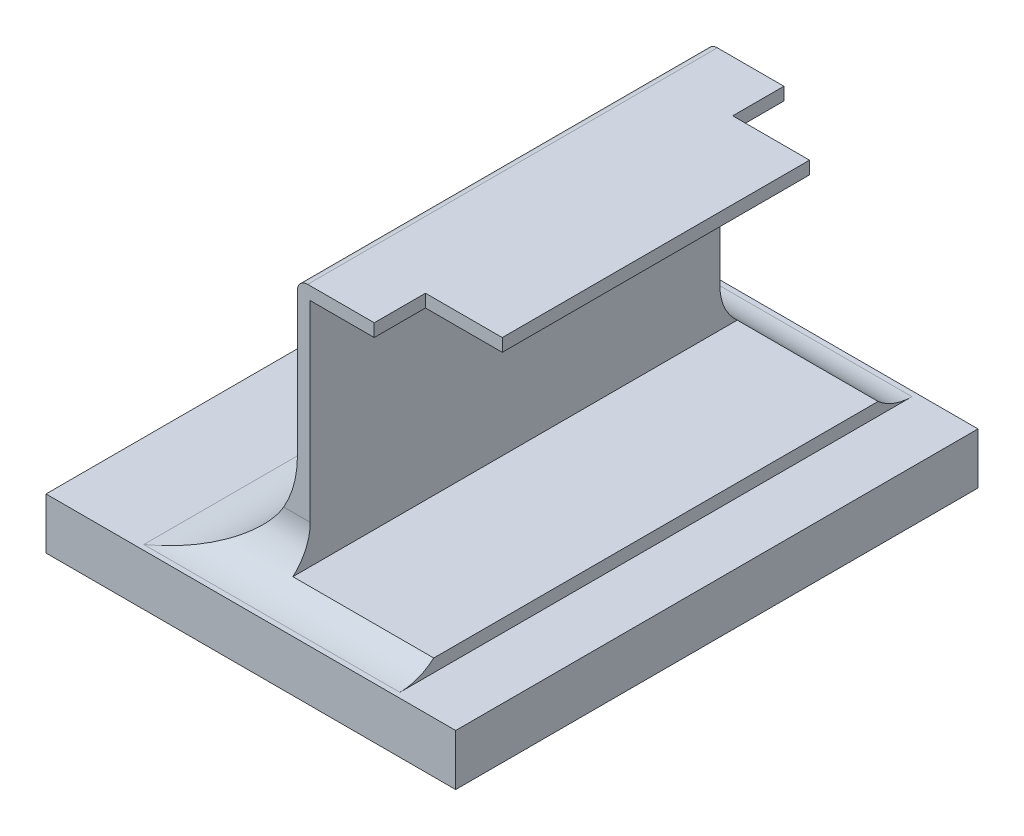
ISO-10303-21;
HEADER;
FILE_DESCRIPTION(('STEP AP214'),'2;1');
FILE_NAME('part.step','',(''),(''),'','','');
FILE_SCHEMA(('AUTOMOTIVE_DESIGN { 1 0 10303 214 1 1 1 1 }'));
ENDSEC;
DATA;
#1=APPLICATION_CONTEXT('core data for automotive mechanical design processes');
#2=APPLICATION_PROTOCOL_DEFINITION('international standard','automotive_design',2000,#1);
#3=PRODUCT_CONTEXT('',#1,'mechanical');
#4=PRODUCT('Part','Part','',(#3));
#5=PRODUCT_RELATED_PRODUCT_CATEGORY('part','',(#4));
#6=PRODUCT_DEFINITION_FORMATION('','',#4);
#7=PRODUCT_DEFINITION_CONTEXT('part definition',#1,'design');
#8=PRODUCT_DEFINITION('design','',#6,#7);
#9=PRODUCT_DEFINITION_SHAPE('','',#8);
#10=(LENGTH_UNIT() NAMED_UNIT(*) SI_UNIT(.MILLI.,.METRE.));
#11=(NAMED_UNIT(*) PLANE_ANGLE_UNIT() SI_UNIT($,.RADIAN.));
#12=(NAMED_UNIT(*) SI_UNIT($,.STERADIAN.) SOLID_ANGLE_UNIT());
#13=UNCERTAINTY_MEASURE_WITH_UNIT(LENGTH_MEASURE(1.E-05),#10,'distance_accuracy_value','');
#14=(GEOMETRIC_REPRESENTATION_CONTEXT(3) GLOBAL_UNCERTAINTY_ASSIGNED_CONTEXT((#13)) GLOBAL_UNIT_ASSIGNED_CONTEXT((#10,
#11,#12)) REPRESENTATION_CONTEXT('',''));
#15=CARTESIAN_POINT('',(0.,0.,0.));
#16=DIRECTION('',(0.,0.,1.));
#17=DIRECTION('',(1.,0.,0.));
#18=AXIS2_PLACEMENT_3D('',#15,#16,#17);
#19=CARTESIAN_POINT('',(-0.65,0.575,-0.3));
#20=DIRECTION('',(0.,0.,1.));
#21=DIRECTION('',(1.,0.,0.));
#22=AXIS2_PLACEMENT_3D('',#19,#20,#21);
#23=PLANE('',#22);
#24=DIRECTION('',(0.,1.,0.));
#25=VECTOR('',#24,1.);
#26=CARTESIAN_POINT('',(-0.65,0.575,-0.3));
#27=LINE('',#26,#25);
#28=CARTESIAN_POINT('',(-0.65,0.575,-0.3));
#29=VERTEX_POINT('',#28);
#30=CARTESIAN_POINT('',(-0.650000000008889,0.6,-0.3));
#31=VERTEX_POINT('',#30);
#32=EDGE_CURVE('E214',#29,#31,#27,.T.);
#33=ORIENTED_EDGE('',*,*,#32,.T.);
#34=DIRECTION('',(1.,0.,0.));
#35=VECTOR('',#34,1.);
#36=CARTESIAN_POINT('',(-0.78,0.6,-0.3));
#37=LINE('',#36,#35);
#38=CARTESIAN_POINT('',(-0.5,0.6,-0.3));
#39=VERTEX_POINT('',#38);
#40=EDGE_CURVE('E213',#31,#39,#37,.T.);
#41=ORIENTED_EDGE('',*,*,#40,.T.);
#42=DIRECTION('',(0.,1.,0.));
#43=VECTOR('',#42,1.);
#44=CARTESIAN_POINT('',(-0.5,0.575,-0.3));
#45=LINE('',#44,#43);
#46=CARTESIAN_POINT('',(-0.5,0.575,-0.3));
#47=VERTEX_POINT('',#46);
#48=EDGE_CURVE('E264',#39,#47,#45,.F.);
#49=ORIENTED_EDGE('',*,*,#48,.T.);
#50=DIRECTION('',(1.,0.,0.));
#51=VECTOR('',#50,1.);
#52=CARTESIAN_POINT('',(-0.775,0.575,-0.3));
#53=LINE('',#52,#51);
#54=EDGE_CURVE('E233',#47,#29,#53,.F.);
#55=ORIENTED_EDGE('',*,*,#54,.T.);
#56=EDGE_LOOP('',(#33,#41,#49,#55));
#57=FACE_BOUND('',#56,.T.);
#58=ADVANCED_FACE('F17',(#57),#23,.F.);
#59=CARTESIAN_POINT('',(-0.5,0.575,-0.3));
#60=DIRECTION('',(-1.,0.,0.));
#61=DIRECTION('',(0.,0.,1.));
#62=AXIS2_PLACEMENT_3D('',#59,#60,#61);
#63=PLANE('',#62);
#64=DIRECTION('',(0.,1.,0.));
#65=VECTOR('',#64,1.);
#66=CARTESIAN_POINT('',(-0.5,0.575,0.3));
#67=LINE('',#66,#65);
#68=CARTESIAN_POINT('',(-0.5,0.6,0.3));
#69=VERTEX_POINT('',#68);
#70=CARTESIAN_POINT('',(-0.5,0.575,0.3));
#71=VERTEX_POINT('',#70);
#72=EDGE_CURVE('E256',#69,#71,#67,.F.);
#73=ORIENTED_EDGE('',*,*,#72,.T.);
#74=DIRECTION('',(0.,0.,1.));
#75=VECTOR('',#74,1.);
#76=CARTESIAN_POINT('',(-0.5,0.575,-0.4));
#77=LINE('',#76,#75);
#78=EDGE_CURVE('E246',#71,#47,#77,.F.);
#79=ORIENTED_EDGE('',*,*,#78,.T.);
#80=ORIENTED_EDGE('',*,*,#48,.F.);
#81=DIRECTION('',(0.,0.,-1.));
#82=VECTOR('',#81,1.);
#83=CARTESIAN_POINT('',(-0.5,0.6,0.4));
#84=LINE('',#83,#82);
#85=EDGE_CURVE('E251',#39,#69,#84,.F.);
#86=ORIENTED_EDGE('',*,*,#85,.T.);
#87=EDGE_LOOP('',(#73,#79,#80,#86));
#88=FACE_BOUND('',#87,.T.);
#89=ADVANCED_FACE('F458',(#88),#63,.F.);
#90=CARTESIAN_POINT('',(-0.5,0.575,0.3));
#91=DIRECTION('',(0.,0.,-1.));
#92=DIRECTION('',(-1.,0.,0.));
#93=AXIS2_PLACEMENT_3D('',#90,#91,#92);
#94=PLANE('',#93);
#95=ORIENTED_EDGE('',*,*,#72,.F.);
#96=DIRECTION('',(1.,0.,0.));
#97=VECTOR('',#96,1.);
#98=CARTESIAN_POINT('',(-0.78,0.6,0.3));
#99=LINE('',#98,#97);
#100=CARTESIAN_POINT('',(-0.650000000017778,0.6,0.3));
#101=VERTEX_POINT('',#100);
#102=EDGE_CURVE('E241',#69,#101,#99,.F.);
#103=ORIENTED_EDGE('',*,*,#102,.T.);
#104=DIRECTION('',(0.,1.,0.));
#105=VECTOR('',#104,1.);
#106=CARTESIAN_POINT('',(-0.65,0.575,0.3));
#107=LINE('',#106,#105);
#108=CARTESIAN_POINT('',(-0.649999999967593,0.575,0.3));
#109=VERTEX_POINT('',#108);
#110=EDGE_CURVE('E254',#101,#109,#107,.F.);
#111=ORIENTED_EDGE('',*,*,#110,.T.);
#112=DIRECTION('',(1.,0.,0.));
#113=VECTOR('',#112,1.);
#114=CARTESIAN_POINT('',(-0.775,0.575,0.3));
#115=LINE('',#114,#113);
#116=EDGE_CURVE('E232',#109,#71,#115,.T.);
#117=ORIENTED_EDGE('',*,*,#116,.T.);
#118=EDGE_LOOP('',(#95,#103,#111,#117));
#119=FACE_BOUND('',#118,.T.);
#120=ADVANCED_FACE('F455',(#119),#94,.F.);
#121=CARTESIAN_POINT('',(-0.65,0.575,0.3));
#122=DIRECTION('',(-1.,0.,0.));
#123=DIRECTION('',(0.,0.,1.));
#124=AXIS2_PLACEMENT_3D('',#121,#122,#123);
#125=PLANE('',#124);
#126=ORIENTED_EDGE('',*,*,#110,.F.);
#127=DIRECTION('',(0.,0.,-1.));
#128=VECTOR('',#127,1.);
#129=CARTESIAN_POINT('',(-0.650000000026667,0.6,0.4));
#130=LINE('',#129,#128);
#131=CARTESIAN_POINT('',(-0.649999999967222,0.6,0.4));
#132=VERTEX_POINT('',#131);
#133=EDGE_CURVE('E200',#101,#132,#130,.F.);
#134=ORIENTED_EDGE('',*,*,#133,.T.);
#135=DIRECTION('',(0.,1.,0.));
#136=VECTOR('',#135,1.);
#137=CARTESIAN_POINT('',(-0.6499999999375,0.2,0.4));
#138=LINE('',#137,#136);
#139=CARTESIAN_POINT('',(-0.6499999999375,0.575,0.4));
#140=VERTEX_POINT('',#139);
#141=EDGE_CURVE('E169',#140,#132,#138,.T.);
#142=ORIENTED_EDGE('',*,*,#141,.F.);
#143=DIRECTION('',(0.,0.,1.));
#144=VECTOR('',#143,1.);
#145=CARTESIAN_POINT('',(-0.6499999999375,0.575,-0.4));
#146=LINE('',#145,#144);
#147=EDGE_CURVE('E229',#140,#109,#146,.F.);
#148=ORIENTED_EDGE('',*,*,#147,.T.);
#149=EDGE_LOOP('',(#126,#134,#142,#148));
#150=FACE_BOUND('',#149,.T.);
#151=ADVANCED_FACE('F451',(#150),#125,.F.);
#152=CARTESIAN_POINT('',(-0.775,0.575,-0.4));
#153=DIRECTION('',(0.,1.,0.));
#154=DIRECTION('',(0.,0.,1.));
#155=AXIS2_PLACEMENT_3D('',#152,#153,#154);
#156=PLANE('',#155);
#157=ORIENTED_EDGE('',*,*,#116,.F.);
#158=ORIENTED_EDGE('',*,*,#147,.F.);
#159=DIRECTION('',(1.,0.,0.));
#160=VECTOR('',#159,1.);
#161=CARTESIAN_POINT('',(-0.827855689,0.575,0.4));
#162=LINE('',#161,#160);
#163=CARTESIAN_POINT('',(-0.775000000018434,0.575,0.4));
#164=VERTEX_POINT('',#163);
#165=EDGE_CURVE('E176',#164,#140,#162,.T.);
#166=ORIENTED_EDGE('',*,*,#165,.F.);
#167=DIRECTION('',(0.,0.,1.));
#168=VECTOR('',#167,1.);
#169=CARTESIAN_POINT('',(-0.775,0.575,-0.439062492));
#170=LINE('',#169,#168);
#171=CARTESIAN_POINT('',(-0.775000000015333,0.575,-0.400000000037835));
#172=VERTEX_POINT('',#171);
#173=EDGE_CURVE('E222',#164,#172,#170,.F.);
#174=ORIENTED_EDGE('',*,*,#173,.T.);
#175=DIRECTION('',(1.,0.,0.));
#176=VECTOR('',#175,1.);
#177=CARTESIAN_POINT('',(-0.827855689,0.575,-0.4));
#178=LINE('',#177,#176);
#179=CARTESIAN_POINT('',(-0.649999999993055,0.575,-0.4));
#180=VERTEX_POINT('',#179);
#181=EDGE_CURVE('E207',#172,#180,#178,.T.);
#182=ORIENTED_EDGE('',*,*,#181,.T.);
#183=DIRECTION('',(0.,0.,1.));
#184=VECTOR('',#183,1.);
#185=CARTESIAN_POINT('',(-0.65,0.575,-0.4));
#186=LINE('',#185,#184);
#187=EDGE_CURVE('E210',#180,#29,#186,.T.);
#188=ORIENTED_EDGE('',*,*,#187,.T.);
#189=ORIENTED_EDGE('',*,*,#54,.F.);
#190=ORIENTED_EDGE('',*,*,#78,.F.);
#191=EDGE_LOOP('',(#157,#158,#166,#174,#182,#188,#189,#190));
#192=FACE_BOUND('',#191,.T.);
#193=ADVANCED_FACE('F447',(#192),#156,.F.);
#194=CARTESIAN_POINT('',(-0.65,0.575,-0.4));
#195=DIRECTION('',(-1.,0.,0.));
#196=DIRECTION('',(0.,0.,1.));
#197=AXIS2_PLACEMENT_3D('',#194,#195,#196);
#198=PLANE('',#197);
#199=DIRECTION('',(0.,1.,0.));
#200=VECTOR('',#199,1.);
#201=CARTESIAN_POINT('',(-0.649999999989583,0.2,-0.4));
#202=LINE('',#201,#200);
#203=CARTESIAN_POINT('',(-0.6499999999975,0.6,-0.4));
#204=VERTEX_POINT('',#203);
#205=EDGE_CURVE('E203',#180,#204,#202,.T.);
#206=ORIENTED_EDGE('',*,*,#205,.T.);
#207=DIRECTION('',(0.,0.,-1.));
#208=VECTOR('',#207,1.);
#209=CARTESIAN_POINT('',(-0.650000000013333,0.6,0.4));
#210=LINE('',#209,#208);
#211=EDGE_CURVE('E197',#204,#31,#210,.F.);
#212=ORIENTED_EDGE('',*,*,#211,.T.);
#213=ORIENTED_EDGE('',*,*,#32,.F.);
#214=ORIENTED_EDGE('',*,*,#187,.F.);
#215=EDGE_LOOP('',(#206,#212,#213,#214));
#216=FACE_BOUND('',#215,.T.);
#217=ADVANCED_FACE('F443',(#216),#198,.F.);
#218=CARTESIAN_POINT('',(-0.78,0.6,0.4));
#219=DIRECTION('',(0.,-1.,0.));
#220=DIRECTION('',(0.,0.,-1.));
#221=AXIS2_PLACEMENT_3D('',#218,#219,#220);
#222=PLANE('',#221);
#223=DIRECTION('',(1.,0.,0.));
#224=VECTOR('',#223,1.);
#225=CARTESIAN_POINT('',(-0.827855689,0.6,-0.4));
#226=LINE('',#225,#224);
#227=CARTESIAN_POINT('',(-0.78,0.6,-0.4));
#228=VERTEX_POINT('',#227);
#229=EDGE_CURVE('E206',#204,#228,#226,.F.);
#230=ORIENTED_EDGE('',*,*,#229,.T.);
#231=DIRECTION('',(0.,0.,-1.));
#232=VECTOR('',#231,1.);
#233=CARTESIAN_POINT('',(-0.78,0.6,0.4));
#234=LINE('',#233,#232);
#235=CARTESIAN_POINT('',(-0.78,0.6,0.4));
#236=VERTEX_POINT('',#235);
#237=EDGE_CURVE('E170',#236,#228,#234,.T.);
#238=ORIENTED_EDGE('',*,*,#237,.F.);
#239=DIRECTION('',(1.,0.,0.));
#240=VECTOR('',#239,1.);
#241=CARTESIAN_POINT('',(-0.827855689,0.6,0.4));
#242=LINE('',#241,#240);
#243=EDGE_CURVE('E151',#132,#236,#242,.F.);
#244=ORIENTED_EDGE('',*,*,#243,.F.);
#245=ORIENTED_EDGE('',*,*,#133,.F.);
#246=ORIENTED_EDGE('',*,*,#102,.F.);
#247=ORIENTED_EDGE('',*,*,#85,.F.);
#248=ORIENTED_EDGE('',*,*,#40,.F.);
#249=ORIENTED_EDGE('',*,*,#211,.F.);
#250=EDGE_LOOP('',(#230,#238,#244,#245,#246,#247,#248,#249));
#251=FACE_BOUND('',#250,.T.);
#252=ADVANCED_FACE('F440',(#251),#222,.F.);
#253=CARTESIAN_POINT('',(-0.78,0.58,0.4));
#254=DIRECTION('',(0.,0.,-1.));
#255=DIRECTION('',(-1.,0.,0.));
#256=AXIS2_PLACEMENT_3D('',#253,#254,#255);
#257=CYLINDRICAL_SURFACE('',#256,0.0199999999999999);
#258=DIRECTION('',(0.,0.,-1.));
#259=VECTOR('',#258,1.);
#260=CARTESIAN_POINT('',(-0.8,0.58,-0.4));
#261=LINE('',#260,#259);
#262=CARTESIAN_POINT('',(-0.800000000021836,0.58,-0.4));
#263=VERTEX_POINT('',#262);
#264=CARTESIAN_POINT('',(-0.800000000021836,0.58,0.4));
#265=VERTEX_POINT('',#264);
#266=EDGE_CURVE('E163',#263,#265,#261,.F.);
#267=ORIENTED_EDGE('',*,*,#266,.T.);
#268=CARTESIAN_POINT('',(-0.78,0.58,0.4));
#269=DIRECTION('',(0.,0.,-1.));
#270=DIRECTION('',(-1.,0.,0.));
#271=AXIS2_PLACEMENT_3D('',#268,#269,#270);
#272=CIRCLE('',#271,0.0199999999999999);
#273=EDGE_CURVE('E20',#236,#265,#272,.F.);
#274=ORIENTED_EDGE('',*,*,#273,.F.);
#275=ORIENTED_EDGE('',*,*,#237,.T.);
#276=CARTESIAN_POINT('',(-0.78,0.58,-0.4));
#277=DIRECTION('',(0.,0.,-1.));
#278=DIRECTION('',(-1.,0.,0.));
#279=AXIS2_PLACEMENT_3D('',#276,#277,#278);
#280=CIRCLE('',#279,0.0199999999999999);
#281=EDGE_CURVE('E166',#228,#263,#280,.F.);
#282=ORIENTED_EDGE('',*,*,#281,.T.);
#283=EDGE_LOOP('',(#267,#274,#275,#282));
#284=FACE_BOUND('',#283,.T.);
#285=ADVANCED_FACE('F164',(#284),#257,.T.);
#286=CARTESIAN_POINT('',(-0.8,0.3,-0.4));
#287=DIRECTION('',(1.,0.,0.));
#288=DIRECTION('',(0.,0.,-1.));
#289=AXIS2_PLACEMENT_3D('',#286,#287,#288);
#290=PLANE('',#289);
#291=ORIENTED_EDGE('',*,*,#266,.F.);
#292=DIRECTION('',(0.,1.,0.));
#293=VECTOR('',#292,1.);
#294=CARTESIAN_POINT('',(-0.800000000043671,0.2,-0.4));
#295=LINE('',#294,#293);
#296=CARTESIAN_POINT('',(-0.800000000021836,0.3,-0.400000000001));
#297=VERTEX_POINT('',#296);
#298=EDGE_CURVE('E378',#263,#297,#295,.F.);
#299=ORIENTED_EDGE('',*,*,#298,.T.);
#300=DIRECTION('',(0.,0.,-1.));
#301=VECTOR('',#300,1.);
#302=CARTESIAN_POINT('',(-0.8,0.3,0.506));
#303=LINE('',#302,#301);
#304=CARTESIAN_POINT('',(-0.800000000021836,0.3,0.400000000004));
#305=VERTEX_POINT('',#304);
#306=EDGE_CURVE('E175',#297,#305,#303,.F.);
#307=ORIENTED_EDGE('',*,*,#306,.T.);
#308=DIRECTION('',(0.,1.,0.));
#309=VECTOR('',#308,1.);
#310=CARTESIAN_POINT('',(-0.800000000043671,0.2,0.4));
#311=LINE('',#310,#309);
#312=EDGE_CURVE('E159',#265,#305,#311,.F.);
#313=ORIENTED_EDGE('',*,*,#312,.F.);
#314=EDGE_LOOP('',(#291,#299,#307,#313));
#315=FACE_BOUND('',#314,.T.);
#316=ADVANCED_FACE('F173',(#315),#290,.F.);
#317=CARTESIAN_POINT('',(-0.827855689,0.2,0.4));
#318=DIRECTION('',(0.,0.,1.));
#319=DIRECTION('',(1.,0.,0.));
#320=AXIS2_PLACEMENT_3D('',#317,#318,#319);
#321=PLANE('',#320);
#322=DIRECTION('',(0.,1.,0.));
#323=VECTOR('',#322,1.);
#324=CARTESIAN_POINT('',(-0.775,0.125,0.4));
#325=LINE('',#324,#323);
#326=CARTESIAN_POINT('',(-0.775000000027652,0.200000000006281,0.4));
#327=VERTEX_POINT('',#326);
#328=EDGE_CURVE('E224',#327,#164,#325,.T.);
#329=ORIENTED_EDGE('',*,*,#328,.T.);
#330=ORIENTED_EDGE('',*,*,#165,.T.);
#331=ORIENTED_EDGE('',*,*,#141,.T.);
#332=ORIENTED_EDGE('',*,*,#243,.T.);
#333=ORIENTED_EDGE('',*,*,#273,.T.);
#334=ORIENTED_EDGE('',*,*,#312,.T.);
#335=CARTESIAN_POINT('',(-1.,0.3,0.400000000004));
#336=DIRECTION('',(0.,0.,-1.));
#337=DIRECTION('',(-1.,0.,0.));
#338=AXIS2_PLACEMENT_3D('',#335,#336,#337);
#339=CIRCLE('',#338,0.2);
#340=CARTESIAN_POINT('',(-0.82679491923586,0.200000000012562,0.400000000002));
#341=VERTEX_POINT('',#340);
#342=EDGE_CURVE('E189',#305,#341,#339,.T.);
#343=ORIENTED_EDGE('',*,*,#342,.T.);
#344=DIRECTION('',(-1.,0.,0.));
#345=VECTOR('',#344,1.);
#346=CARTESIAN_POINT('',(-0.5,0.200000000012562,0.4));
#347=LINE('',#346,#345);
#348=EDGE_CURVE('E373',#341,#327,#347,.F.);
#349=ORIENTED_EDGE('',*,*,#348,.T.);
#350=EDGE_LOOP('',(#329,#330,#331,#332,#333,#334,#343,#349));
#351=FACE_BOUND('',#350,.T.);
#352=ADVANCED_FACE('F156',(#351),#321,.T.);
#353=CARTESIAN_POINT('',(-0.775,0.125,0.433856217));
#354=DIRECTION('',(0.,-1.,0.));
#355=DIRECTION('',(0.,0.,-1.));
#356=AXIS2_PLACEMENT_3D('',#353,#354,#355);
#357=PLANE('',#356);
#358=DIRECTION('',(-1.,0.,0.));
#359=VECTOR('',#358,1.);
#360=CARTESIAN_POINT('',(-0.5,0.124999999995673,0.433856217228291));
#361=LINE('',#360,#359);
#362=CARTESIAN_POINT('',(-0.775000000027652,0.125000000019696,0.433856217210132));
#363=VERTEX_POINT('',#362);
#364=CARTESIAN_POINT('',(-0.5,0.124999999991523,0.433856217232998));
#365=VERTEX_POINT('',#364);
#366=EDGE_CURVE('E191',#363,#365,#361,.F.);
#367=ORIENTED_EDGE('',*,*,#366,.T.);
#368=DIRECTION('',(0.,0.,1.));
#369=VECTOR('',#368,1.);
#370=CARTESIAN_POINT('',(-0.5,0.124999999987372,-0.506));
#371=LINE('',#370,#369);
#372=CARTESIAN_POINT('',(-0.5,0.125000000003993,-0.433856217218857));
#373=VERTEX_POINT('',#372);
#374=EDGE_CURVE('E376',#365,#373,#371,.F.);
#375=ORIENTED_EDGE('',*,*,#374,.T.);
#376=DIRECTION('',(1.,0.,0.));
#377=VECTOR('',#376,1.);
#378=CARTESIAN_POINT('',(-1.003,0.125000000020615,-0.433856217200011));
#379=LINE('',#378,#377);
#380=CARTESIAN_POINT('',(-0.7750000000115,0.125000000025932,-0.433856217195991));
#381=VERTEX_POINT('',#380);
#382=EDGE_CURVE('E183',#373,#381,#379,.F.);
#383=ORIENTED_EDGE('',*,*,#382,.T.);
#384=DIRECTION('',(0.,0.,1.));
#385=VECTOR('',#384,1.);
#386=CARTESIAN_POINT('',(-0.775,0.125000000027704,-0.439062492));
#387=LINE('',#386,#385);
#388=EDGE_CURVE('E179',#381,#363,#387,.T.);
#389=ORIENTED_EDGE('',*,*,#388,.T.);
#390=EDGE_LOOP('',(#367,#375,#383,#389));
#391=FACE_BOUND('',#390,.T.);
#392=ADVANCED_FACE('F393',(#391),#357,.F.);
#393=CARTESIAN_POINT('',(-0.775,0.125,-0.439062492));
#394=DIRECTION('',(-1.,0.,0.));
#395=DIRECTION('',(0.,0.,1.));
#396=AXIS2_PLACEMENT_3D('',#393,#394,#395);
#397=PLANE('',#396);
#398=ORIENTED_EDGE('',*,*,#173,.F.);
#399=ORIENTED_EDGE('',*,*,#328,.F.);
#400=CARTESIAN_POINT('',(-0.775000000055303,0.2,0.5));
#401=DIRECTION('',(-1.,0.,0.));
#402=DIRECTION('',(0.,0.,1.));
#403=AXIS2_PLACEMENT_3D('',#400,#401,#402);
#404=CIRCLE('',#403,0.1);
#405=EDGE_CURVE('E194',#327,#363,#404,.T.);
#406=ORIENTED_EDGE('',*,*,#405,.T.);
#407=ORIENTED_EDGE('',*,*,#388,.F.);
#408=CARTESIAN_POINT('',(-0.775000000023,0.2,-0.5));
#409=DIRECTION('',(1.,0.,0.));
#410=DIRECTION('',(0.,0.,-1.));
#411=AXIS2_PLACEMENT_3D('',#408,#409,#410);
#412=CIRCLE('',#411,0.1);
#413=CARTESIAN_POINT('',(-0.775000000023,0.2,-0.4));
#414=VERTEX_POINT('',#413);
#415=EDGE_CURVE('E297',#381,#414,#412,.F.);
#416=ORIENTED_EDGE('',*,*,#415,.T.);
#417=DIRECTION('',(0.,1.,0.));
#418=VECTOR('',#417,1.);
#419=CARTESIAN_POINT('',(-0.775000000023,0.2,-0.4));
#420=LINE('',#419,#418);
#421=EDGE_CURVE('E219',#414,#172,#420,.T.);
#422=ORIENTED_EDGE('',*,*,#421,.T.);
#423=EDGE_LOOP('',(#398,#399,#406,#407,#416,#422));
#424=FACE_BOUND('',#423,.T.);
#425=ADVANCED_FACE('F407',(#424),#397,.F.);
#426=CARTESIAN_POINT('',(-0.827855689,0.2,-0.4));
#427=DIRECTION('',(0.,0.,1.));
#428=DIRECTION('',(1.,0.,0.));
#429=AXIS2_PLACEMENT_3D('',#426,#427,#428);
#430=PLANE('',#429);
#431=ORIENTED_EDGE('',*,*,#298,.F.);
#432=ORIENTED_EDGE('',*,*,#281,.F.);
#433=ORIENTED_EDGE('',*,*,#229,.F.);
#434=ORIENTED_EDGE('',*,*,#205,.F.);
#435=ORIENTED_EDGE('',*,*,#181,.F.);
#436=ORIENTED_EDGE('',*,*,#421,.F.);
#437=DIRECTION('',(1.,0.,0.));
#438=VECTOR('',#437,1.);
#439=CARTESIAN_POINT('',(-1.003,0.2,-0.4));
#440=LINE('',#439,#438);
#441=CARTESIAN_POINT('',(-0.826794919244061,0.199999999998357,-0.4000000000005));
#442=VERTEX_POINT('',#441);
#443=EDGE_CURVE('E296',#414,#442,#440,.F.);
#444=ORIENTED_EDGE('',*,*,#443,.T.);
#445=CARTESIAN_POINT('',(-1.,0.3,-0.400000000001));
#446=DIRECTION('',(0.,0.,-1.));
#447=DIRECTION('',(-1.,0.,0.));
#448=AXIS2_PLACEMENT_3D('',#445,#446,#447);
#449=CIRCLE('',#448,0.2);
#450=EDGE_CURVE('E190',#442,#297,#449,.F.);
#451=ORIENTED_EDGE('',*,*,#450,.T.);
#452=EDGE_LOOP('',(#431,#432,#433,#434,#435,#436,#444,#451));
#453=FACE_BOUND('',#452,.T.);
#454=ADVANCED_FACE('F425',(#453),#430,.F.);
#455=CARTESIAN_POINT('',(-0.5,0.1,-0.506));
#456=DIRECTION('',(-1.,0.,0.));
#457=DIRECTION('',(0.,0.,1.));
#458=AXIS2_PLACEMENT_3D('',#455,#456,#457);
#459=PLANE('',#458);
#460=CARTESIAN_POINT('',(-0.5,0.2,0.5));
#461=DIRECTION('',(-1.,0.,0.));
#462=DIRECTION('',(0.,0.,1.));
#463=AXIS2_PLACEMENT_3D('',#460,#461,#462);
#464=CIRCLE('',#463,0.1);
#465=CARTESIAN_POINT('',(-0.5,0.1,0.499999999995192));
#466=VERTEX_POINT('',#465);
#467=EDGE_CURVE('E193',#365,#466,#464,.T.);
#468=ORIENTED_EDGE('',*,*,#467,.T.);
#469=DIRECTION('',(0.,0.,1.));
#470=VECTOR('',#469,1.);
#471=CARTESIAN_POINT('',(-0.5,0.1,-0.51));
#472=LINE('',#471,#470);
#473=CARTESIAN_POINT('',(-0.5,0.1,-0.499999999963977));
#474=VERTEX_POINT('',#473);
#475=EDGE_CURVE('E295',#474,#466,#472,.T.);
#476=ORIENTED_EDGE('',*,*,#475,.F.);
#477=CARTESIAN_POINT('',(-0.5,0.2,-0.5));
#478=DIRECTION('',(1.,0.,0.));
#479=DIRECTION('',(0.,0.,-1.));
#480=AXIS2_PLACEMENT_3D('',#477,#478,#479);
#481=CIRCLE('',#480,0.1);
#482=EDGE_CURVE('E418',#474,#373,#481,.F.);
#483=ORIENTED_EDGE('',*,*,#482,.T.);
#484=ORIENTED_EDGE('',*,*,#374,.F.);
#485=EDGE_LOOP('',(#468,#476,#483,#484));
#486=FACE_BOUND('',#485,.T.);
#487=ADVANCED_FACE('F422',(#486),#459,.F.);
#488=CARTESIAN_POINT('',(-0.5,0.2,0.5));
#489=DIRECTION('',(-1.,0.,0.));
#490=DIRECTION('',(0.,0.,1.));
#491=AXIS2_PLACEMENT_3D('',#488,#489,#490);
#492=CYLINDRICAL_SURFACE('',#491,0.1);
#493=CARTESIAN_POINT('',(-0.82679491923586,0.200000000012562,0.4));
#494=CARTESIAN_POINT('',(-0.831120530798744,0.192485690415418,0.400008857799293));
#495=CARTESIAN_POINT('',(-0.835916451406672,0.185326558509338,0.40084269301434));
#496=CARTESIAN_POINT('',(-0.846163216281841,0.171925193467618,0.403779236330584));
#497=CARTESIAN_POINT('',(-0.851604196424111,0.165671750286134,0.405864418294367));
#498=CARTESIAN_POINT('',(-0.864070184354919,0.152971591031053,0.411426534374426));
#499=CARTESIAN_POINT('',(-0.871199452040891,0.146715187150713,0.415092977762791));
#500=CARTESIAN_POINT('',(-0.885961995048183,0.135433526925337,0.423317803109864));
#501=CARTESIAN_POINT('',(-0.89359806815349,0.130415977715775,0.427881466349634));
#502=CARTESIAN_POINT('',(-0.912340896385359,0.119793250216144,0.439567119261472));
#503=CARTESIAN_POINT('',(-0.923599763484876,0.114774375151044,0.446976253691696));
#504=CARTESIAN_POINT('',(-0.946410917717563,0.106936347930993,0.462398506969008));
#505=CARTESIAN_POINT('',(-0.957962784551457,0.104114210578039,0.470410789877432));
#506=CARTESIAN_POINT('',(-0.978923226465547,0.100889583874045,0.48510113572731));
#507=CARTESIAN_POINT('',(-0.98830874720824,0.100121610174059,0.491733388479142));
#508=CARTESIAN_POINT('',(-0.998460423973696,0.10000444919043,0.498911355870459));
#509=CARTESIAN_POINT('',(-0.999230237064579,0.100000006341012,0.499455696073852));
#510=CARTESIAN_POINT('',(-1.,0.1,0.5));
#511=B_SPLINE_CURVE_WITH_KNOTS('',3,(#493,#494,#495,#496,#497,#498,#499,#500,#501,#502,#503,
#504,#505,#506,#507,#508,#509,#510),.UNSPECIFIED.,.F.,.F.,(4,2,2,2,2,2,2,2,4),(0.,
0.0258484357677545,0.0513430265918677,0.0816965683513661,0.11223443862456,0.155151467041947,
0.198010072196932,0.232479852237767,0.235308310792188),.UNSPECIFIED.);
#512=CARTESIAN_POINT('',(-0.999999999965675,0.1,0.499999999984522));
#513=VERTEX_POINT('',#512);
#514=EDGE_CURVE('E414',#341,#513,#511,.T.);
#515=ORIENTED_EDGE('',*,*,#514,.T.);
#516=DIRECTION('',(1.,0.,0.));
#517=VECTOR('',#516,1.);
#518=CARTESIAN_POINT('',(-1.181,0.1,0.499999999990383));
#519=LINE('',#518,#517);
#520=EDGE_CURVE('E368',#466,#513,#519,.F.);
#521=ORIENTED_EDGE('',*,*,#520,.F.);
#522=ORIENTED_EDGE('',*,*,#467,.F.);
#523=ORIENTED_EDGE('',*,*,#366,.F.);
#524=ORIENTED_EDGE('',*,*,#405,.F.);
#525=ORIENTED_EDGE('',*,*,#348,.F.);
#526=EDGE_LOOP('',(#515,#521,#522,#523,#524,#525));
#527=FACE_BOUND('',#526,.T.);
#528=ADVANCED_FACE('F403',(#527),#492,.F.);
#529=CARTESIAN_POINT('',(-1.,0.3,0.506));
#530=DIRECTION('',(0.,0.,-1.));
#531=DIRECTION('',(-1.,0.,0.));
#532=AXIS2_PLACEMENT_3D('',#529,#530,#531);
#533=CYLINDRICAL_SURFACE('',#532,0.2);
#534=ORIENTED_EDGE('',*,*,#342,.F.);
#535=ORIENTED_EDGE('',*,*,#306,.F.);
#536=ORIENTED_EDGE('',*,*,#450,.F.);
#537=CARTESIAN_POINT('',(-0.826794919245009,0.199999999996715,-0.4));
#538=CARTESIAN_POINT('',(-0.831120530808544,0.19248569040005,-0.400008857800487));
#539=CARTESIAN_POINT('',(-0.835916451417017,0.185326558494557,-0.400842693016559));
#540=CARTESIAN_POINT('',(-0.846163216293114,0.171925193454087,-0.40377923633456));
#541=CARTESIAN_POINT('',(-0.851604196435772,0.165671750273265,-0.405864418299083));
#542=CARTESIAN_POINT('',(-0.864070184368188,0.152971591018722,-0.411426534380925));
#543=CARTESIAN_POINT('',(-0.871199452055447,0.146715187138428,-0.415092977770458));
#544=CARTESIAN_POINT('',(-0.885961995065299,0.135433526913424,-0.423317803119846));
#545=CARTESIAN_POINT('',(-0.893598068171879,0.130415977704191,-0.427881466360763));
#546=CARTESIAN_POINT('',(-0.912340896406504,0.119793250205794,-0.43956711927513));
#547=CARTESIAN_POINT('',(-0.923599763507471,0.114774375141661,-0.446976253706679));
#548=CARTESIAN_POINT('',(-0.946410917742956,0.106936347923887,-0.462398506986466));
#549=CARTESIAN_POINT('',(-0.957962784578197,0.104114210572239,-0.470410789896037));
#550=CARTESIAN_POINT('',(-0.978923226484311,0.100889583872512,-0.48510113574057));
#551=CARTESIAN_POINT('',(-0.988308747217613,0.100121610173951,-0.491733388485764));
#552=CARTESIAN_POINT('',(-0.998460423973697,0.10000444919043,-0.498911355870458));
#553=CARTESIAN_POINT('',(-0.999230237064579,0.100000006341012,-0.499455696073851));
#554=CARTESIAN_POINT('',(-1.,0.1,-0.5));
#555=B_SPLINE_CURVE_WITH_KNOTS('',3,(#537,#538,#539,#540,#541,#542,#543,#544,#545,#546,#547,
#548,#549,#550,#551,#552,#553,#554),.UNSPECIFIED.,.F.,.F.,(4,2,2,2,2,2,2,2,4),(0.,
0.0258484357675321,0.0513430265915152,0.0816965683548746,0.112234438631965,0.155151467053784,
0.198010072213119,0.232479852219529,0.23530831077395),.UNSPECIFIED.);
#556=CARTESIAN_POINT('',(-0.999999999942698,0.1,-0.49999999993706));
#557=VERTEX_POINT('',#556);
#558=EDGE_CURVE('E287',#442,#557,#555,.T.);
#559=ORIENTED_EDGE('',*,*,#558,.T.);
#560=DIRECTION('',(0.,0.,1.));
#561=VECTOR('',#560,1.);
#562=CARTESIAN_POINT('',(-0.999999999961531,0.1,-0.51));
#563=LINE('',#562,#561);
#564=EDGE_CURVE('E366',#513,#557,#563,.F.);
#565=ORIENTED_EDGE('',*,*,#564,.F.);
#566=ORIENTED_EDGE('',*,*,#514,.F.);
#567=EDGE_LOOP('',(#534,#535,#536,#559,#565,#566));
#568=FACE_BOUND('',#567,.T.);
#569=ADVANCED_FACE('F299',(#568),#533,.F.);
#570=CARTESIAN_POINT('',(-1.003,0.2,-0.5));
#571=DIRECTION('',(1.,0.,0.));
#572=DIRECTION('',(0.,0.,-1.));
#573=AXIS2_PLACEMENT_3D('',#570,#571,#572);
#574=CYLINDRICAL_SURFACE('',#573,0.1);
#575=ORIENTED_EDGE('',*,*,#558,.F.);
#576=ORIENTED_EDGE('',*,*,#443,.F.);
#577=ORIENTED_EDGE('',*,*,#415,.F.);
#578=ORIENTED_EDGE('',*,*,#382,.F.);
#579=ORIENTED_EDGE('',*,*,#482,.F.);
#580=DIRECTION('',(1.,0.,0.));
#581=VECTOR('',#580,1.);
#582=CARTESIAN_POINT('',(-1.181,0.1,-0.499999999927954));
#583=LINE('',#582,#581);
#584=EDGE_CURVE('E363',#557,#474,#583,.T.);
#585=ORIENTED_EDGE('',*,*,#584,.F.);
#586=EDGE_LOOP('',(#575,#576,#577,#578,#579,#585));
#587=FACE_BOUND('',#586,.T.);
#588=ADVANCED_FACE('F302',(#587),#574,.F.);
#589=CARTESIAN_POINT('',(-1.181,0.1,-0.51));
#590=DIRECTION('',(0.,1.,0.));
#591=DIRECTION('',(0.,0.,1.));
#592=AXIS2_PLACEMENT_3D('',#589,#590,#591);
#593=PLANE('',#592);
#594=ORIENTED_EDGE('',*,*,#564,.T.);
#595=ORIENTED_EDGE('',*,*,#584,.T.);
#596=ORIENTED_EDGE('',*,*,#475,.T.);
#597=ORIENTED_EDGE('',*,*,#520,.T.);
#598=EDGE_LOOP('',(#594,#595,#596,#597));
#599=FACE_BOUND('',#598,.T.);
#600=DIRECTION('',(0.,0.,-1.));
#601=VECTOR('',#600,1.);
#602=CARTESIAN_POINT('',(-1.181,0.1,0.51));
#603=LINE('',#602,#601);
#604=CARTESIAN_POINT('',(-1.181,0.1,-0.51));
#605=VERTEX_POINT('',#604);
#606=CARTESIAN_POINT('',(-1.181,0.1,0.51));
#607=VERTEX_POINT('',#606);
#608=EDGE_CURVE('E346',#605,#607,#603,.F.);
#609=ORIENTED_EDGE('',*,*,#608,.T.);
#610=DIRECTION('',(-1.,0.,0.));
#611=VECTOR('',#610,1.);
#612=CARTESIAN_POINT('',(-0.381,0.1,0.51));
#613=LINE('',#612,#611);
#614=CARTESIAN_POINT('',(-0.381,0.1,0.51));
#615=VERTEX_POINT('',#614);
#616=EDGE_CURVE('E361',#607,#615,#613,.F.);
#617=ORIENTED_EDGE('',*,*,#616,.T.);
#618=DIRECTION('',(0.,0.,1.));
#619=VECTOR('',#618,1.);
#620=CARTESIAN_POINT('',(-0.381,0.1,-0.51));
#621=LINE('',#620,#619);
#622=CARTESIAN_POINT('',(-0.381,0.1,-0.51));
#623=VERTEX_POINT('',#622);
#624=EDGE_CURVE('E358',#615,#623,#621,.F.);
#625=ORIENTED_EDGE('',*,*,#624,.T.);
#626=DIRECTION('',(1.,0.,0.));
#627=VECTOR('',#626,1.);
#628=CARTESIAN_POINT('',(-1.181,0.1,-0.51));
#629=LINE('',#628,#627);
#630=EDGE_CURVE('E355',#623,#605,#629,.F.);
#631=ORIENTED_EDGE('',*,*,#630,.T.);
#632=EDGE_LOOP('',(#609,#617,#625,#631));
#633=FACE_BOUND('',#632,.T.);
#634=ADVANCED_FACE('F306',(#599,#633),#593,.T.);
#635=CARTESIAN_POINT('',(-0.381,0.,0.51));
#636=DIRECTION('',(0.,0.,-1.));
#637=DIRECTION('',(-1.,0.,0.));
#638=AXIS2_PLACEMENT_3D('',#635,#636,#637);
#639=PLANE('',#638);
#640=DIRECTION('',(0.,1.,0.));
#641=VECTOR('',#640,1.);
#642=CARTESIAN_POINT('',(-1.181,0.,0.51));
#643=LINE('',#642,#641);
#644=CARTESIAN_POINT('',(-1.181,0.,0.51));
#645=VERTEX_POINT('',#644);
#646=EDGE_CURVE('E352',#607,#645,#643,.F.);
#647=ORIENTED_EDGE('',*,*,#646,.T.);
#648=DIRECTION('',(1.,0.,0.));
#649=VECTOR('',#648,1.);
#650=CARTESIAN_POINT('',(-1.181,0.,0.51));
#651=LINE('',#650,#649);
#652=CARTESIAN_POINT('',(-0.381,0.,0.51));
#653=VERTEX_POINT('',#652);
#654=EDGE_CURVE('E344',#645,#653,#651,.T.);
#655=ORIENTED_EDGE('',*,*,#654,.T.);
#656=DIRECTION('',(0.,1.,0.));
#657=VECTOR('',#656,1.);
#658=CARTESIAN_POINT('',(-0.381,0.,0.51));
#659=LINE('',#658,#657);
#660=EDGE_CURVE('E343',#653,#615,#659,.T.);
#661=ORIENTED_EDGE('',*,*,#660,.T.);
#662=ORIENTED_EDGE('',*,*,#616,.F.);
#663=EDGE_LOOP('',(#647,#655,#661,#662));
#664=FACE_BOUND('',#663,.T.);
#665=ADVANCED_FACE('F310',(#664),#639,.F.);
#666=CARTESIAN_POINT('',(-0.381,0.,-0.51));
#667=DIRECTION('',(-1.,0.,0.));
#668=DIRECTION('',(0.,0.,1.));
#669=AXIS2_PLACEMENT_3D('',#666,#667,#668);
#670=PLANE('',#669);
#671=ORIENTED_EDGE('',*,*,#660,.F.);
#672=DIRECTION('',(0.,0.,1.));
#673=VECTOR('',#672,1.);
#674=CARTESIAN_POINT('',(-0.381,0.,-0.51));
#675=LINE('',#674,#673);
#676=CARTESIAN_POINT('',(-0.381,0.,-0.51));
#677=VERTEX_POINT('',#676);
#678=EDGE_CURVE('E336',#653,#677,#675,.F.);
#679=ORIENTED_EDGE('',*,*,#678,.T.);
#680=DIRECTION('',(0.,1.,0.));
#681=VECTOR('',#680,1.);
#682=CARTESIAN_POINT('',(-0.381,0.,-0.51));
#683=LINE('',#682,#681);
#684=EDGE_CURVE('E341',#677,#623,#683,.T.);
#685=ORIENTED_EDGE('',*,*,#684,.T.);
#686=ORIENTED_EDGE('',*,*,#624,.F.);
#687=EDGE_LOOP('',(#671,#679,#685,#686));
#688=FACE_BOUND('',#687,.T.);
#689=ADVANCED_FACE('F314',(#688),#670,.F.);
#690=CARTESIAN_POINT('',(-1.181,0.,-0.51));
#691=DIRECTION('',(0.,0.,1.));
#692=DIRECTION('',(1.,0.,0.));
#693=AXIS2_PLACEMENT_3D('',#690,#691,#692);
#694=PLANE('',#693);
#695=ORIENTED_EDGE('',*,*,#684,.F.);
#696=DIRECTION('',(1.,0.,0.));
#697=VECTOR('',#696,1.);
#698=CARTESIAN_POINT('',(-1.181,0.,-0.51));
#699=LINE('',#698,#697);
#700=CARTESIAN_POINT('',(-1.181,0.,-0.51));
#701=VERTEX_POINT('',#700);
#702=EDGE_CURVE('E26',#677,#701,#699,.F.);
#703=ORIENTED_EDGE('',*,*,#702,.T.);
#704=DIRECTION('',(0.,1.,0.));
#705=VECTOR('',#704,1.);
#706=CARTESIAN_POINT('',(-1.181,0.,-0.51));
#707=LINE('',#706,#705);
#708=EDGE_CURVE('E34',#701,#605,#707,.T.);
#709=ORIENTED_EDGE('',*,*,#708,.T.);
#710=ORIENTED_EDGE('',*,*,#630,.F.);
#711=EDGE_LOOP('',(#695,#703,#709,#710));
#712=FACE_BOUND('',#711,.T.);
#713=ADVANCED_FACE('F318',(#712),#694,.F.);
#714=CARTESIAN_POINT('',(-1.181,0.,0.51));
#715=DIRECTION('',(1.,0.,0.));
#716=DIRECTION('',(0.,0.,-1.));
#717=AXIS2_PLACEMENT_3D('',#714,#715,#716);
#718=PLANE('',#717);
#719=ORIENTED_EDGE('',*,*,#708,.F.);
#720=DIRECTION('',(0.,0.,1.));
#721=VECTOR('',#720,1.);
#722=CARTESIAN_POINT('',(-1.181,0.,-0.51));
#723=LINE('',#722,#721);
#724=EDGE_CURVE('E11',#701,#645,#723,.T.);
#725=ORIENTED_EDGE('',*,*,#724,.T.);
#726=ORIENTED_EDGE('',*,*,#646,.F.);
#727=ORIENTED_EDGE('',*,*,#608,.F.);
#728=EDGE_LOOP('',(#719,#725,#726,#727));
#729=FACE_BOUND('',#728,.T.);
#730=ADVANCED_FACE('F322',(#729),#718,.F.);
#731=CARTESIAN_POINT('',(-1.181,0.,-0.51));
#732=DIRECTION('',(0.,1.,0.));
#733=DIRECTION('',(0.,0.,1.));
#734=AXIS2_PLACEMENT_3D('',#731,#732,#733);
#735=PLANE('',#734);
#736=ORIENTED_EDGE('',*,*,#702,.F.);
#737=ORIENTED_EDGE('',*,*,#678,.F.);
#738=ORIENTED_EDGE('',*,*,#654,.F.);
#739=ORIENTED_EDGE('',*,*,#724,.F.);
#740=EDGE_LOOP('',(#736,#737,#738,#739));
#741=FACE_BOUND('',#740,.T.);
#742=ADVANCED_FACE('F326',(#741),#735,.F.);
#743=CLOSED_SHELL('',(#58,#89,#120,#151,#193,#217,#252,#285,#316,#352,#392,#425,#454,#487,#528,
#569,#588,#634,#665,#689,#713,#730,#742));
#744=MANIFOLD_SOLID_BREP('B1',#743);
#745=ADVANCED_BREP_SHAPE_REPRESENTATION('',(#18,#744),#14);
#746=SHAPE_DEFINITION_REPRESENTATION(#9,#745);
ENDSEC;
END-ISO-10303-21;
